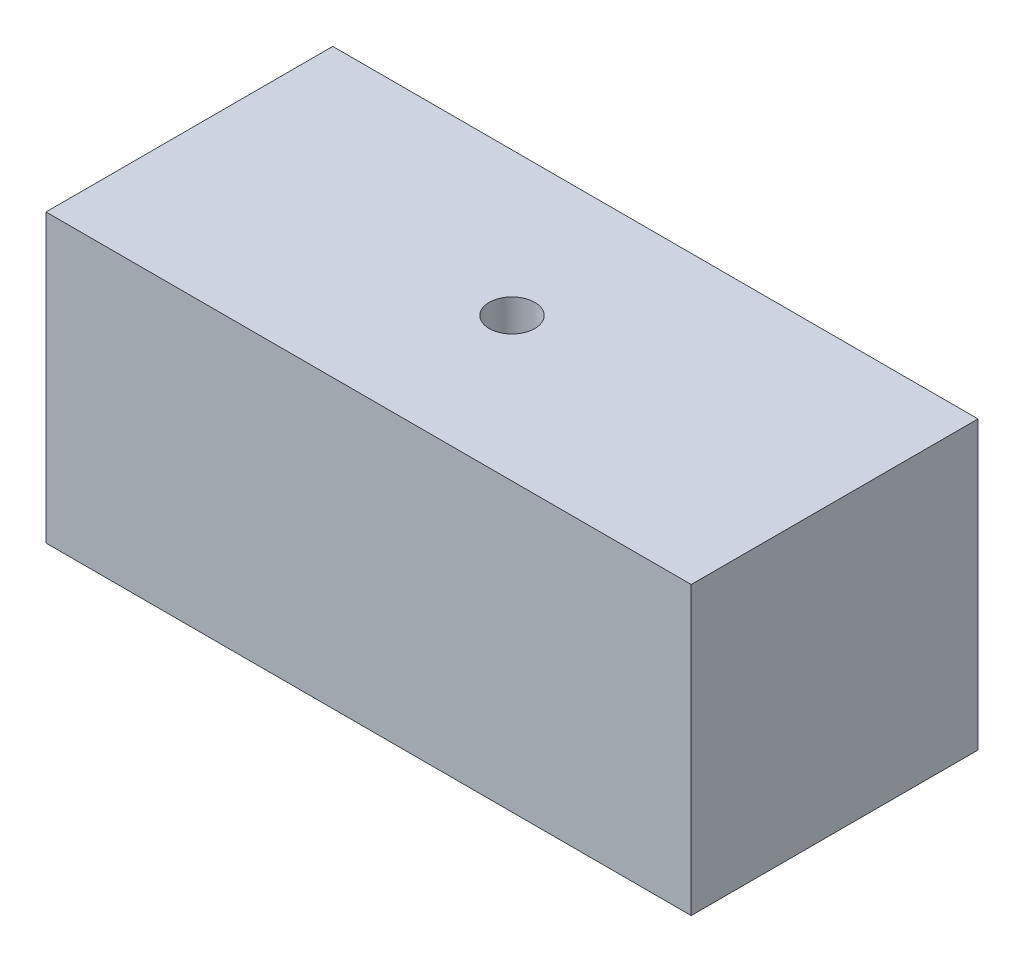
ISO-10303-21;
HEADER;
FILE_DESCRIPTION(('STEP AP214'),'2;1');
FILE_NAME('part.step','',(''),(''),'','','');
FILE_SCHEMA(('AUTOMOTIVE_DESIGN { 1 0 10303 214 1 1 1 1 }'));
ENDSEC;
DATA;
#1=APPLICATION_CONTEXT('core data for automotive mechanical design processes');
#2=APPLICATION_PROTOCOL_DEFINITION('international standard','automotive_design',2000,#1);
#3=PRODUCT_CONTEXT('',#1,'mechanical');
#4=PRODUCT('Part','Part','',(#3));
#5=PRODUCT_RELATED_PRODUCT_CATEGORY('part','',(#4));
#6=PRODUCT_DEFINITION_FORMATION('','',#4);
#7=PRODUCT_DEFINITION_CONTEXT('part definition',#1,'design');
#8=PRODUCT_DEFINITION('design','',#6,#7);
#9=PRODUCT_DEFINITION_SHAPE('','',#8);
#10=(LENGTH_UNIT() NAMED_UNIT(*) SI_UNIT(.MILLI.,.METRE.));
#11=(NAMED_UNIT(*) PLANE_ANGLE_UNIT() SI_UNIT($,.RADIAN.));
#12=(NAMED_UNIT(*) SI_UNIT($,.STERADIAN.) SOLID_ANGLE_UNIT());
#13=UNCERTAINTY_MEASURE_WITH_UNIT(LENGTH_MEASURE(1.E-05),#10,'distance_accuracy_value','');
#14=(GEOMETRIC_REPRESENTATION_CONTEXT(3) GLOBAL_UNCERTAINTY_ASSIGNED_CONTEXT((#13)) GLOBAL_UNIT_ASSIGNED_CONTEXT((#10,
#11,#12)) REPRESENTATION_CONTEXT('',''));
#15=CARTESIAN_POINT('',(0.,0.,0.));
#16=DIRECTION('',(0.,0.,1.));
#17=DIRECTION('',(1.,0.,0.));
#18=AXIS2_PLACEMENT_3D('',#15,#16,#17);
#19=CARTESIAN_POINT('',(-45.,40.,-20.));
#20=DIRECTION('',(0.,0.,1.));
#21=DIRECTION('',(1.,0.,0.));
#22=AXIS2_PLACEMENT_3D('',#19,#20,#21);
#23=PLANE('',#22);
#24=DIRECTION('',(-1.,0.,0.));
#25=VECTOR('',#24,1.);
#26=CARTESIAN_POINT('',(-45.,0.,-20.));
#27=LINE('',#26,#25);
#28=CARTESIAN_POINT('',(45.,0.,-20.));
#29=VERTEX_POINT('',#28);
#30=CARTESIAN_POINT('',(-45.,0.,-20.));
#31=VERTEX_POINT('',#30);
#32=EDGE_CURVE('E90',#29,#31,#27,.T.);
#33=ORIENTED_EDGE('',*,*,#32,.T.);
#34=DIRECTION('',(0.,-1.,0.));
#35=VECTOR('',#34,1.);
#36=CARTESIAN_POINT('',(-45.,40.,-20.));
#37=LINE('',#36,#35);
#38=CARTESIAN_POINT('',(-45.,40.,-20.));
#39=VERTEX_POINT('',#38);
#40=EDGE_CURVE('E88',#39,#31,#37,.T.);
#41=ORIENTED_EDGE('',*,*,#40,.F.);
#42=DIRECTION('',(-1.,0.,0.));
#43=VECTOR('',#42,1.);
#44=CARTESIAN_POINT('',(-45.,40.,-20.));
#45=LINE('',#44,#43);
#46=CARTESIAN_POINT('',(45.,40.,-20.));
#47=VERTEX_POINT('',#46);
#48=EDGE_CURVE('E80',#47,#39,#45,.T.);
#49=ORIENTED_EDGE('',*,*,#48,.F.);
#50=DIRECTION('',(0.,-1.,0.));
#51=VECTOR('',#50,1.);
#52=CARTESIAN_POINT('',(45.,40.,-20.));
#53=LINE('',#52,#51);
#54=EDGE_CURVE('E41',#47,#29,#53,.T.);
#55=ORIENTED_EDGE('',*,*,#54,.T.);
#56=EDGE_LOOP('',(#33,#41,#49,#55));
#57=FACE_BOUND('',#56,.T.);
#58=CARTESIAN_POINT('',(25.,20.,-20.));
#59=DIRECTION('',(0.,0.,1.));
#60=DIRECTION('',(1.,0.,0.));
#61=AXIS2_PLACEMENT_3D('',#58,#59,#60);
#62=CIRCLE('',#61,10.);
#63=CARTESIAN_POINT('',(35.,20.,-20.));
#64=VERTEX_POINT('',#63);
#65=EDGE_CURVE('E11',#64,#64,#62,.F.);
#66=ORIENTED_EDGE('',*,*,#65,.F.);
#67=EDGE_LOOP('',(#66));
#68=FACE_BOUND('',#67,.T.);
#69=ADVANCED_FACE('F32',(#57,#68),#23,.F.);
#70=CARTESIAN_POINT('',(45.,40.,-20.));
#71=DIRECTION('',(-1.,0.,0.));
#72=DIRECTION('',(0.,0.,1.));
#73=AXIS2_PLACEMENT_3D('',#70,#71,#72);
#74=PLANE('',#73);
#75=DIRECTION('',(0.,0.,-1.));
#76=VECTOR('',#75,1.);
#77=CARTESIAN_POINT('',(45.,0.,-20.));
#78=LINE('',#77,#76);
#79=CARTESIAN_POINT('',(45.,0.,20.));
#80=VERTEX_POINT('',#79);
#81=EDGE_CURVE('E99',#80,#29,#78,.T.);
#82=ORIENTED_EDGE('',*,*,#81,.T.);
#83=ORIENTED_EDGE('',*,*,#54,.F.);
#84=DIRECTION('',(0.,0.,-1.));
#85=VECTOR('',#84,1.);
#86=CARTESIAN_POINT('',(45.,40.,-20.));
#87=LINE('',#86,#85);
#88=CARTESIAN_POINT('',(45.,40.,20.));
#89=VERTEX_POINT('',#88);
#90=EDGE_CURVE('E85',#89,#47,#87,.T.);
#91=ORIENTED_EDGE('',*,*,#90,.F.);
#92=DIRECTION('',(0.,-1.,0.));
#93=VECTOR('',#92,1.);
#94=CARTESIAN_POINT('',(45.,40.,20.));
#95=LINE('',#94,#93);
#96=EDGE_CURVE('E95',#89,#80,#95,.T.);
#97=ORIENTED_EDGE('',*,*,#96,.T.);
#98=EDGE_LOOP('',(#82,#83,#91,#97));
#99=FACE_BOUND('',#98,.T.);
#100=ADVANCED_FACE('F34',(#99),#74,.F.);
#101=CARTESIAN_POINT('',(-45.,40.,-20.));
#102=DIRECTION('',(1.,0.,0.));
#103=DIRECTION('',(0.,0.,-1.));
#104=AXIS2_PLACEMENT_3D('',#101,#102,#103);
#105=PLANE('',#104);
#106=DIRECTION('',(0.,0.,1.));
#107=VECTOR('',#106,1.);
#108=CARTESIAN_POINT('',(-45.,0.,-20.));
#109=LINE('',#108,#107);
#110=CARTESIAN_POINT('',(-45.,0.,20.));
#111=VERTEX_POINT('',#110);
#112=EDGE_CURVE('E66',#31,#111,#109,.T.);
#113=ORIENTED_EDGE('',*,*,#112,.T.);
#114=DIRECTION('',(0.,-1.,0.));
#115=VECTOR('',#114,1.);
#116=CARTESIAN_POINT('',(-45.,40.,20.));
#117=LINE('',#116,#115);
#118=CARTESIAN_POINT('',(-45.,40.,20.));
#119=VERTEX_POINT('',#118);
#120=EDGE_CURVE('E91',#119,#111,#117,.T.);
#121=ORIENTED_EDGE('',*,*,#120,.F.);
#122=DIRECTION('',(0.,0.,1.));
#123=VECTOR('',#122,1.);
#124=CARTESIAN_POINT('',(-45.,40.,-20.));
#125=LINE('',#124,#123);
#126=EDGE_CURVE('E83',#39,#119,#125,.T.);
#127=ORIENTED_EDGE('',*,*,#126,.F.);
#128=ORIENTED_EDGE('',*,*,#40,.T.);
#129=EDGE_LOOP('',(#113,#121,#127,#128));
#130=FACE_BOUND('',#129,.T.);
#131=ADVANCED_FACE('F93',(#130),#105,.F.);
#132=CARTESIAN_POINT('',(-45.,40.,20.));
#133=DIRECTION('',(0.,0.,-1.));
#134=DIRECTION('',(-1.,0.,0.));
#135=AXIS2_PLACEMENT_3D('',#132,#133,#134);
#136=PLANE('',#135);
#137=DIRECTION('',(1.,0.,0.));
#138=VECTOR('',#137,1.);
#139=CARTESIAN_POINT('',(-45.,0.,20.));
#140=LINE('',#139,#138);
#141=EDGE_CURVE('E72',#111,#80,#140,.T.);
#142=ORIENTED_EDGE('',*,*,#141,.T.);
#143=ORIENTED_EDGE('',*,*,#96,.F.);
#144=DIRECTION('',(1.,0.,0.));
#145=VECTOR('',#144,1.);
#146=CARTESIAN_POINT('',(-45.,40.,20.));
#147=LINE('',#146,#145);
#148=EDGE_CURVE('E49',#119,#89,#147,.T.);
#149=ORIENTED_EDGE('',*,*,#148,.F.);
#150=ORIENTED_EDGE('',*,*,#120,.T.);
#151=EDGE_LOOP('',(#142,#143,#149,#150));
#152=FACE_BOUND('',#151,.T.);
#153=ADVANCED_FACE('F122',(#152),#136,.F.);
#154=CARTESIAN_POINT('',(0.,40.,0.));
#155=DIRECTION('',(0.,1.,0.));
#156=DIRECTION('',(0.,0.,1.));
#157=AXIS2_PLACEMENT_3D('',#154,#155,#156);
#158=PLANE('',#157);
#159=CARTESIAN_POINT('',(0.,40.,0.));
#160=DIRECTION('',(0.,1.,0.));
#161=DIRECTION('',(0.,0.,1.));
#162=AXIS2_PLACEMENT_3D('',#159,#160,#161);
#163=CIRCLE('',#162,3.175);
#164=CARTESIAN_POINT('',(0.,40.,3.17500000000001));
#165=VERTEX_POINT('',#164);
#166=EDGE_CURVE('E183',#165,#165,#163,.T.);
#167=ORIENTED_EDGE('',*,*,#166,.F.);
#168=EDGE_LOOP('',(#167));
#169=FACE_BOUND('',#168,.T.);
#170=ORIENTED_EDGE('',*,*,#90,.T.);
#171=ORIENTED_EDGE('',*,*,#48,.T.);
#172=ORIENTED_EDGE('',*,*,#126,.T.);
#173=ORIENTED_EDGE('',*,*,#148,.T.);
#174=EDGE_LOOP('',(#170,#171,#172,#173));
#175=FACE_BOUND('',#174,.T.);
#176=ADVANCED_FACE('F81',(#169,#175),#158,.T.);
#177=CARTESIAN_POINT('',(0.,0.,0.));
#178=DIRECTION('',(0.,1.,0.));
#179=DIRECTION('',(0.,0.,1.));
#180=AXIS2_PLACEMENT_3D('',#177,#178,#179);
#181=PLANE('',#180);
#182=CARTESIAN_POINT('',(0.,0.,0.));
#183=DIRECTION('',(0.,1.,0.));
#184=DIRECTION('',(0.,0.,1.));
#185=AXIS2_PLACEMENT_3D('',#182,#183,#184);
#186=CIRCLE('',#185,3.175);
#187=CARTESIAN_POINT('',(0.,0.,3.17500000000001));
#188=VERTEX_POINT('',#187);
#189=EDGE_CURVE('E181',#188,#188,#186,.T.);
#190=ORIENTED_EDGE('',*,*,#189,.T.);
#191=EDGE_LOOP('',(#190));
#192=FACE_BOUND('',#191,.T.);
#193=ORIENTED_EDGE('',*,*,#81,.F.);
#194=ORIENTED_EDGE('',*,*,#141,.F.);
#195=ORIENTED_EDGE('',*,*,#112,.F.);
#196=ORIENTED_EDGE('',*,*,#32,.F.);
#197=EDGE_LOOP('',(#193,#194,#195,#196));
#198=FACE_BOUND('',#197,.T.);
#199=ADVANCED_FACE('F110',(#192,#198),#181,.F.);
#200=CARTESIAN_POINT('',(25.,20.,-25.));
#201=DIRECTION('',(0.,0.,1.));
#202=DIRECTION('',(1.,0.,0.));
#203=AXIS2_PLACEMENT_3D('',#200,#201,#202);
#204=CYLINDRICAL_SURFACE('',#203,10.);
#205=CARTESIAN_POINT('',(25.,20.,-25.));
#206=DIRECTION('',(0.,0.,-1.));
#207=DIRECTION('',(-1.,0.,0.));
#208=AXIS2_PLACEMENT_3D('',#205,#206,#207);
#209=CIRCLE('',#208,10.);
#210=CARTESIAN_POINT('',(15.,20.,-25.));
#211=VERTEX_POINT('',#210);
#212=EDGE_CURVE('E102',#211,#211,#209,.T.);
#213=ORIENTED_EDGE('',*,*,#212,.F.);
#214=EDGE_LOOP('',(#213));
#215=FACE_BOUND('',#214,.T.);
#216=ORIENTED_EDGE('',*,*,#65,.T.);
#217=EDGE_LOOP('',(#216));
#218=FACE_BOUND('',#217,.T.);
#219=ADVANCED_FACE('F112',(#215,#218),#204,.T.);
#220=CARTESIAN_POINT('',(25.,20.,-25.));
#221=DIRECTION('',(0.,0.,-1.));
#222=DIRECTION('',(-1.,0.,0.));
#223=AXIS2_PLACEMENT_3D('',#220,#221,#222);
#224=PLANE('',#223);
#225=ORIENTED_EDGE('',*,*,#212,.T.);
#226=EDGE_LOOP('',(#225));
#227=FACE_BOUND('',#226,.T.);
#228=ADVANCED_FACE('F119',(#227),#224,.T.);
#229=CARTESIAN_POINT('',(0.,0.,0.));
#230=DIRECTION('',(0.,1.,0.));
#231=DIRECTION('',(0.,0.,1.));
#232=AXIS2_PLACEMENT_3D('',#229,#230,#231);
#233=CYLINDRICAL_SURFACE('',#232,3.175);
#234=ORIENTED_EDGE('',*,*,#189,.F.);
#235=EDGE_LOOP('',(#234));
#236=FACE_BOUND('',#235,.T.);
#237=ORIENTED_EDGE('',*,*,#166,.T.);
#238=EDGE_LOOP('',(#237));
#239=FACE_BOUND('',#238,.T.);
#240=ADVANCED_FACE('F157',(#236,#239),#233,.F.);
#241=CLOSED_SHELL('',(#69,#100,#131,#153,#176,#199,#219,#228,#240));
#242=MANIFOLD_SOLID_BREP('B2',#241);
#243=ADVANCED_BREP_SHAPE_REPRESENTATION('',(#18,#242),#14);
#244=SHAPE_DEFINITION_REPRESENTATION(#9,#243);
ENDSEC;
END-ISO-10303-21;
